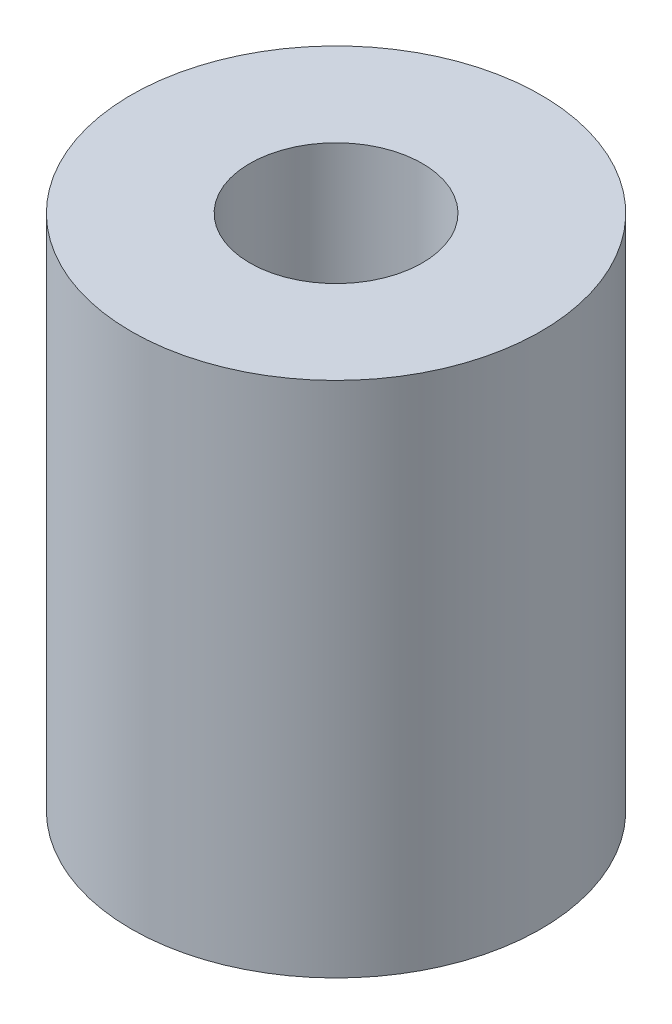
ISO-10303-21;
HEADER;
FILE_DESCRIPTION(('STEP AP214'),'2;1');
FILE_NAME('part.step','',(''),(''),'','','');
FILE_SCHEMA(('AUTOMOTIVE_DESIGN { 1 0 10303 214 1 1 1 1 }'));
ENDSEC;
DATA;
#1=APPLICATION_CONTEXT('core data for automotive mechanical design processes');
#2=APPLICATION_PROTOCOL_DEFINITION('international standard','automotive_design',2000,#1);
#3=PRODUCT_CONTEXT('',#1,'mechanical');
#4=PRODUCT('Part','Part','',(#3));
#5=PRODUCT_RELATED_PRODUCT_CATEGORY('part','',(#4));
#6=PRODUCT_DEFINITION_FORMATION('','',#4);
#7=PRODUCT_DEFINITION_CONTEXT('part definition',#1,'design');
#8=PRODUCT_DEFINITION('design','',#6,#7);
#9=PRODUCT_DEFINITION_SHAPE('','',#8);
#10=(LENGTH_UNIT() NAMED_UNIT(*) SI_UNIT(.MILLI.,.METRE.));
#11=(NAMED_UNIT(*) PLANE_ANGLE_UNIT() SI_UNIT($,.RADIAN.));
#12=(NAMED_UNIT(*) SI_UNIT($,.STERADIAN.) SOLID_ANGLE_UNIT());
#13=UNCERTAINTY_MEASURE_WITH_UNIT(LENGTH_MEASURE(1.E-05),#10,'distance_accuracy_value','');
#14=(GEOMETRIC_REPRESENTATION_CONTEXT(3) GLOBAL_UNCERTAINTY_ASSIGNED_CONTEXT((#13)) GLOBAL_UNIT_ASSIGNED_CONTEXT((#10,
#11,#12)) REPRESENTATION_CONTEXT('',''));
#15=CARTESIAN_POINT('',(0.,0.,0.));
#16=DIRECTION('',(0.,0.,1.));
#17=DIRECTION('',(1.,0.,0.));
#18=AXIS2_PLACEMENT_3D('',#15,#16,#17);
#19=CARTESIAN_POINT('',(0.,24.,0.));
#20=DIRECTION('',(0.,-1.,0.));
#21=DIRECTION('',(0.,0.,-1.));
#22=AXIS2_PLACEMENT_3D('',#19,#20,#21);
#23=CYLINDRICAL_SURFACE('',#22,9.5);
#24=CARTESIAN_POINT('',(0.,24.,0.));
#25=DIRECTION('',(0.,1.,0.));
#26=DIRECTION('',(0.,0.,1.));
#27=AXIS2_PLACEMENT_3D('',#24,#25,#26);
#28=CIRCLE('',#27,9.5);
#29=CARTESIAN_POINT('',(0.,24.,9.5));
#30=VERTEX_POINT('',#29);
#31=EDGE_CURVE('E10',#30,#30,#28,.T.);
#32=ORIENTED_EDGE('',*,*,#31,.F.);
#33=EDGE_LOOP('',(#32));
#34=FACE_BOUND('',#33,.T.);
#35=CARTESIAN_POINT('',(0.,0.,0.));
#36=DIRECTION('',(0.,1.,0.));
#37=DIRECTION('',(0.,0.,1.));
#38=AXIS2_PLACEMENT_3D('',#35,#36,#37);
#39=CIRCLE('',#38,9.5);
#40=CARTESIAN_POINT('',(0.,0.,9.5));
#41=VERTEX_POINT('',#40);
#42=EDGE_CURVE('E35',#41,#41,#39,.T.);
#43=ORIENTED_EDGE('',*,*,#42,.T.);
#44=EDGE_LOOP('',(#43));
#45=FACE_BOUND('',#44,.T.);
#46=ADVANCED_FACE('F32',(#34,#45),#23,.T.);
#47=CARTESIAN_POINT('',(0.,24.,0.));
#48=DIRECTION('',(0.,1.,0.));
#49=DIRECTION('',(0.,0.,1.));
#50=AXIS2_PLACEMENT_3D('',#47,#48,#49);
#51=PLANE('',#50);
#52=CARTESIAN_POINT('',(0.,24.,0.));
#53=DIRECTION('',(0.,1.,0.));
#54=DIRECTION('',(0.,0.,1.));
#55=AXIS2_PLACEMENT_3D('',#52,#53,#54);
#56=CIRCLE('',#55,4.);
#57=CARTESIAN_POINT('',(0.,24.,4.));
#58=VERTEX_POINT('',#57);
#59=EDGE_CURVE('E44',#58,#58,#56,.T.);
#60=ORIENTED_EDGE('',*,*,#59,.F.);
#61=EDGE_LOOP('',(#60));
#62=FACE_BOUND('',#61,.T.);
#63=ORIENTED_EDGE('',*,*,#31,.T.);
#64=EDGE_LOOP('',(#63));
#65=FACE_BOUND('',#64,.T.);
#66=ADVANCED_FACE('F69',(#62,#65),#51,.T.);
#67=CARTESIAN_POINT('',(0.,0.,0.));
#68=DIRECTION('',(0.,1.,0.));
#69=DIRECTION('',(0.,0.,1.));
#70=AXIS2_PLACEMENT_3D('',#67,#68,#69);
#71=PLANE('',#70);
#72=CARTESIAN_POINT('',(0.,0.,0.));
#73=DIRECTION('',(0.,-1.,0.));
#74=DIRECTION('',(0.,0.,-1.));
#75=AXIS2_PLACEMENT_3D('',#72,#73,#74);
#76=CIRCLE('',#75,2.5);
#77=CARTESIAN_POINT('',(0.,0.,-2.5));
#78=VERTEX_POINT('',#77);
#79=EDGE_CURVE('E50',#78,#78,#76,.T.);
#80=ORIENTED_EDGE('',*,*,#79,.F.);
#81=EDGE_LOOP('',(#80));
#82=FACE_BOUND('',#81,.T.);
#83=ORIENTED_EDGE('',*,*,#42,.F.);
#84=EDGE_LOOP('',(#83));
#85=FACE_BOUND('',#84,.T.);
#86=ADVANCED_FACE('F65',(#82,#85),#71,.F.);
#87=CARTESIAN_POINT('',(0.,12.,0.));
#88=DIRECTION('',(0.,1.,0.));
#89=DIRECTION('',(0.,0.,1.));
#90=AXIS2_PLACEMENT_3D('',#87,#88,#89);
#91=CYLINDRICAL_SURFACE('',#90,4.);
#92=CARTESIAN_POINT('',(0.,12.,0.));
#93=DIRECTION('',(0.,1.,0.));
#94=DIRECTION('',(0.,0.,1.));
#95=AXIS2_PLACEMENT_3D('',#92,#93,#94);
#96=CIRCLE('',#95,4.);
#97=CARTESIAN_POINT('',(0.,12.,4.));
#98=VERTEX_POINT('',#97);
#99=EDGE_CURVE('E42',#98,#98,#96,.T.);
#100=ORIENTED_EDGE('',*,*,#99,.F.);
#101=EDGE_LOOP('',(#100));
#102=FACE_BOUND('',#101,.T.);
#103=ORIENTED_EDGE('',*,*,#59,.T.);
#104=EDGE_LOOP('',(#103));
#105=FACE_BOUND('',#104,.T.);
#106=ADVANCED_FACE('F68',(#102,#105),#91,.F.);
#107=CARTESIAN_POINT('',(0.,12.,0.));
#108=DIRECTION('',(0.,1.,0.));
#109=DIRECTION('',(0.,0.,1.));
#110=AXIS2_PLACEMENT_3D('',#107,#108,#109);
#111=PLANE('',#110);
#112=CARTESIAN_POINT('',(0.,12.,0.));
#113=DIRECTION('',(0.,-1.,0.));
#114=DIRECTION('',(0.,0.,-1.));
#115=AXIS2_PLACEMENT_3D('',#112,#113,#114);
#116=CIRCLE('',#115,2.5);
#117=CARTESIAN_POINT('',(0.,12.,-2.5));
#118=VERTEX_POINT('',#117);
#119=EDGE_CURVE('E47',#118,#118,#116,.T.);
#120=ORIENTED_EDGE('',*,*,#119,.T.);
#121=EDGE_LOOP('',(#120));
#122=FACE_BOUND('',#121,.T.);
#123=ORIENTED_EDGE('',*,*,#99,.T.);
#124=EDGE_LOOP('',(#123));
#125=FACE_BOUND('',#124,.T.);
#126=ADVANCED_FACE('F56',(#122,#125),#111,.T.);
#127=CARTESIAN_POINT('',(0.,12.,0.));
#128=DIRECTION('',(0.,-1.,0.));
#129=DIRECTION('',(0.,0.,-1.));
#130=AXIS2_PLACEMENT_3D('',#127,#128,#129);
#131=CYLINDRICAL_SURFACE('',#130,2.5);
#132=ORIENTED_EDGE('',*,*,#119,.F.);
#133=EDGE_LOOP('',(#132));
#134=FACE_BOUND('',#133,.T.);
#135=ORIENTED_EDGE('',*,*,#79,.T.);
#136=EDGE_LOOP('',(#135));
#137=FACE_BOUND('',#136,.T.);
#138=ADVANCED_FACE('F59',(#134,#137),#131,.F.);
#139=CLOSED_SHELL('',(#46,#66,#86,#106,#126,#138));
#140=MANIFOLD_SOLID_BREP('B2',#139);
#141=ADVANCED_BREP_SHAPE_REPRESENTATION('',(#18,#140),#14);
#142=SHAPE_DEFINITION_REPRESENTATION(#9,#141);
ENDSEC;
END-ISO-10303-21;
